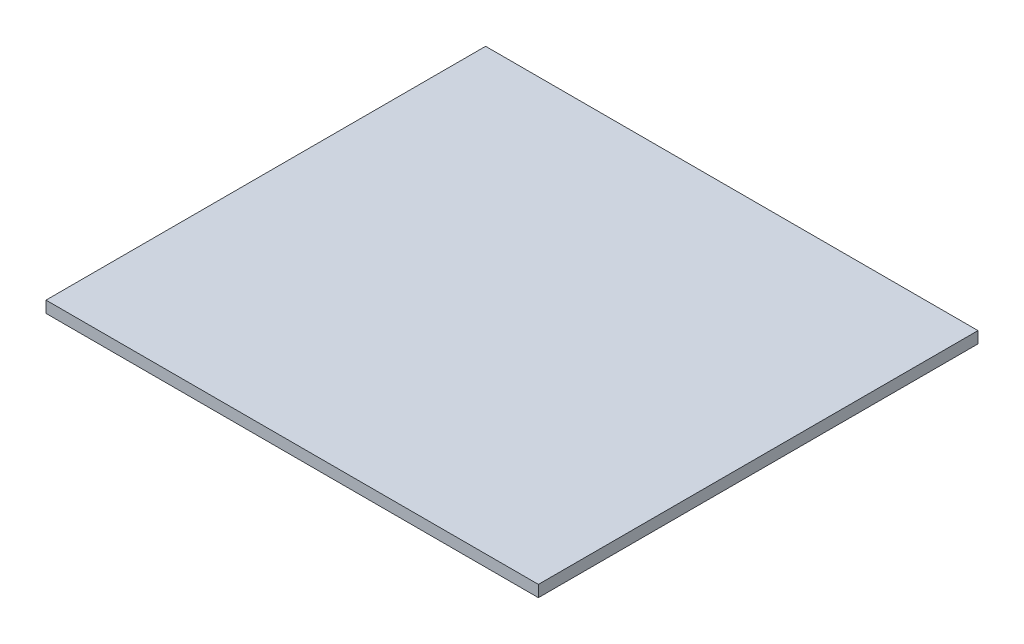
ISO-10303-21;
HEADER;
FILE_DESCRIPTION(('STEP AP214'),'2;1');
FILE_NAME('part.step','',(''),(''),'','','');
FILE_SCHEMA(('AUTOMOTIVE_DESIGN { 1 0 10303 214 1 1 1 1 }'));
ENDSEC;
DATA;
#1=APPLICATION_CONTEXT('core data for automotive mechanical design processes');
#2=APPLICATION_PROTOCOL_DEFINITION('international standard','automotive_design',2000,#1);
#3=PRODUCT_CONTEXT('',#1,'mechanical');
#4=PRODUCT('Part','Part','',(#3));
#5=PRODUCT_RELATED_PRODUCT_CATEGORY('part','',(#4));
#6=PRODUCT_DEFINITION_FORMATION('','',#4);
#7=PRODUCT_DEFINITION_CONTEXT('part definition',#1,'design');
#8=PRODUCT_DEFINITION('design','',#6,#7);
#9=PRODUCT_DEFINITION_SHAPE('','',#8);
#10=(LENGTH_UNIT() NAMED_UNIT(*) SI_UNIT(.MILLI.,.METRE.));
#11=(NAMED_UNIT(*) PLANE_ANGLE_UNIT() SI_UNIT($,.RADIAN.));
#12=(NAMED_UNIT(*) SI_UNIT($,.STERADIAN.) SOLID_ANGLE_UNIT());
#13=UNCERTAINTY_MEASURE_WITH_UNIT(LENGTH_MEASURE(1.E-05),#10,'distance_accuracy_value','');
#14=(GEOMETRIC_REPRESENTATION_CONTEXT(3) GLOBAL_UNCERTAINTY_ASSIGNED_CONTEXT((#13)) GLOBAL_UNIT_ASSIGNED_CONTEXT((#10,
#11,#12)) REPRESENTATION_CONTEXT('',''));
#15=CARTESIAN_POINT('',(0.,0.,0.));
#16=DIRECTION('',(0.,0.,1.));
#17=DIRECTION('',(1.,0.,0.));
#18=AXIS2_PLACEMENT_3D('',#15,#16,#17);
#19=CARTESIAN_POINT('',(29.85,1.4,-26.65));
#20=DIRECTION('',(-1.,0.,0.));
#21=DIRECTION('',(0.,0.,1.));
#22=AXIS2_PLACEMENT_3D('',#19,#20,#21);
#23=PLANE('',#22);
#24=DIRECTION('',(0.,0.,-1.));
#25=VECTOR('',#24,1.);
#26=CARTESIAN_POINT('',(29.85,0.,-26.65));
#27=LINE('',#26,#25);
#28=CARTESIAN_POINT('',(29.85,0.,26.65));
#29=VERTEX_POINT('',#28);
#30=CARTESIAN_POINT('',(29.85,0.,-26.65));
#31=VERTEX_POINT('',#30);
#32=EDGE_CURVE('E94',#29,#31,#27,.T.);
#33=ORIENTED_EDGE('',*,*,#32,.T.);
#34=DIRECTION('',(0.,-1.,0.));
#35=VECTOR('',#34,1.);
#36=CARTESIAN_POINT('',(29.85,1.4,-26.65));
#37=LINE('',#36,#35);
#38=CARTESIAN_POINT('',(29.85,1.4,-26.65));
#39=VERTEX_POINT('',#38);
#40=EDGE_CURVE('E11',#39,#31,#37,.T.);
#41=ORIENTED_EDGE('',*,*,#40,.F.);
#42=DIRECTION('',(0.,0.,-1.));
#43=VECTOR('',#42,1.);
#44=CARTESIAN_POINT('',(29.85,1.4,-26.65));
#45=LINE('',#44,#43);
#46=CARTESIAN_POINT('',(29.85,1.4,26.65));
#47=VERTEX_POINT('',#46);
#48=EDGE_CURVE('E82',#47,#39,#45,.T.);
#49=ORIENTED_EDGE('',*,*,#48,.F.);
#50=DIRECTION('',(0.,-1.,0.));
#51=VECTOR('',#50,1.);
#52=CARTESIAN_POINT('',(29.85,1.4,26.65));
#53=LINE('',#52,#51);
#54=EDGE_CURVE('E90',#47,#29,#53,.T.);
#55=ORIENTED_EDGE('',*,*,#54,.T.);
#56=EDGE_LOOP('',(#33,#41,#49,#55));
#57=FACE_BOUND('',#56,.T.);
#58=ADVANCED_FACE('F31',(#57),#23,.F.);
#59=CARTESIAN_POINT('',(-29.85,1.4,-26.65));
#60=DIRECTION('',(0.,0.,1.));
#61=DIRECTION('',(1.,0.,0.));
#62=AXIS2_PLACEMENT_3D('',#59,#60,#61);
#63=PLANE('',#62);
#64=DIRECTION('',(-1.,0.,0.));
#65=VECTOR('',#64,1.);
#66=CARTESIAN_POINT('',(-29.85,0.,-26.65));
#67=LINE('',#66,#65);
#68=CARTESIAN_POINT('',(-29.85,0.,-26.65));
#69=VERTEX_POINT('',#68);
#70=EDGE_CURVE('E86',#31,#69,#67,.T.);
#71=ORIENTED_EDGE('',*,*,#70,.T.);
#72=DIRECTION('',(0.,-1.,0.));
#73=VECTOR('',#72,1.);
#74=CARTESIAN_POINT('',(-29.85,1.4,-26.65));
#75=LINE('',#74,#73);
#76=CARTESIAN_POINT('',(-29.85,1.4,-26.65));
#77=VERTEX_POINT('',#76);
#78=EDGE_CURVE('E39',#77,#69,#75,.T.);
#79=ORIENTED_EDGE('',*,*,#78,.F.);
#80=DIRECTION('',(-1.,0.,0.));
#81=VECTOR('',#80,1.);
#82=CARTESIAN_POINT('',(-29.85,1.4,-26.65));
#83=LINE('',#82,#81);
#84=EDGE_CURVE('E77',#39,#77,#83,.T.);
#85=ORIENTED_EDGE('',*,*,#84,.F.);
#86=ORIENTED_EDGE('',*,*,#40,.T.);
#87=EDGE_LOOP('',(#71,#79,#85,#86));
#88=FACE_BOUND('',#87,.T.);
#89=ADVANCED_FACE('F85',(#88),#63,.F.);
#90=CARTESIAN_POINT('',(-29.85,1.4,-26.65));
#91=DIRECTION('',(1.,0.,0.));
#92=DIRECTION('',(0.,0.,-1.));
#93=AXIS2_PLACEMENT_3D('',#90,#91,#92);
#94=PLANE('',#93);
#95=DIRECTION('',(0.,0.,1.));
#96=VECTOR('',#95,1.);
#97=CARTESIAN_POINT('',(-29.85,0.,-26.65));
#98=LINE('',#97,#96);
#99=CARTESIAN_POINT('',(-29.85,0.,26.65));
#100=VERTEX_POINT('',#99);
#101=EDGE_CURVE('E64',#69,#100,#98,.T.);
#102=ORIENTED_EDGE('',*,*,#101,.T.);
#103=DIRECTION('',(0.,-1.,0.));
#104=VECTOR('',#103,1.);
#105=CARTESIAN_POINT('',(-29.85,1.4,26.65));
#106=LINE('',#105,#104);
#107=CARTESIAN_POINT('',(-29.85,1.4,26.65));
#108=VERTEX_POINT('',#107);
#109=EDGE_CURVE('E87',#108,#100,#106,.T.);
#110=ORIENTED_EDGE('',*,*,#109,.F.);
#111=DIRECTION('',(0.,0.,1.));
#112=VECTOR('',#111,1.);
#113=CARTESIAN_POINT('',(-29.85,1.4,-26.65));
#114=LINE('',#113,#112);
#115=EDGE_CURVE('E80',#77,#108,#114,.T.);
#116=ORIENTED_EDGE('',*,*,#115,.F.);
#117=ORIENTED_EDGE('',*,*,#78,.T.);
#118=EDGE_LOOP('',(#102,#110,#116,#117));
#119=FACE_BOUND('',#118,.T.);
#120=ADVANCED_FACE('F88',(#119),#94,.F.);
#121=CARTESIAN_POINT('',(-29.85,1.4,26.65));
#122=DIRECTION('',(0.,0.,-1.));
#123=DIRECTION('',(-1.,0.,0.));
#124=AXIS2_PLACEMENT_3D('',#121,#122,#123);
#125=PLANE('',#124);
#126=DIRECTION('',(1.,0.,0.));
#127=VECTOR('',#126,1.);
#128=CARTESIAN_POINT('',(-29.85,0.,26.65));
#129=LINE('',#128,#127);
#130=EDGE_CURVE('E70',#100,#29,#129,.T.);
#131=ORIENTED_EDGE('',*,*,#130,.T.);
#132=ORIENTED_EDGE('',*,*,#54,.F.);
#133=DIRECTION('',(1.,0.,0.));
#134=VECTOR('',#133,1.);
#135=CARTESIAN_POINT('',(-29.85,1.4,26.65));
#136=LINE('',#135,#134);
#137=EDGE_CURVE('E47',#108,#47,#136,.T.);
#138=ORIENTED_EDGE('',*,*,#137,.F.);
#139=ORIENTED_EDGE('',*,*,#109,.T.);
#140=EDGE_LOOP('',(#131,#132,#138,#139));
#141=FACE_BOUND('',#140,.T.);
#142=ADVANCED_FACE('F101',(#141),#125,.F.);
#143=CARTESIAN_POINT('',(29.85,1.4,26.65));
#144=DIRECTION('',(0.,1.,0.));
#145=DIRECTION('',(0.,0.,1.));
#146=AXIS2_PLACEMENT_3D('',#143,#144,#145);
#147=PLANE('',#146);
#148=ORIENTED_EDGE('',*,*,#48,.T.);
#149=ORIENTED_EDGE('',*,*,#84,.T.);
#150=ORIENTED_EDGE('',*,*,#115,.T.);
#151=ORIENTED_EDGE('',*,*,#137,.T.);
#152=EDGE_LOOP('',(#148,#149,#150,#151));
#153=FACE_BOUND('',#152,.T.);
#154=ADVANCED_FACE('F78',(#153),#147,.T.);
#155=CARTESIAN_POINT('',(29.85,0.,26.65));
#156=DIRECTION('',(0.,1.,0.));
#157=DIRECTION('',(0.,0.,1.));
#158=AXIS2_PLACEMENT_3D('',#155,#156,#157);
#159=PLANE('',#158);
#160=ORIENTED_EDGE('',*,*,#32,.F.);
#161=ORIENTED_EDGE('',*,*,#130,.F.);
#162=ORIENTED_EDGE('',*,*,#101,.F.);
#163=ORIENTED_EDGE('',*,*,#70,.F.);
#164=EDGE_LOOP('',(#160,#161,#162,#163));
#165=FACE_BOUND('',#164,.T.);
#166=ADVANCED_FACE('F104',(#165),#159,.F.);
#167=CLOSED_SHELL('',(#58,#89,#120,#142,#154,#166));
#168=MANIFOLD_SOLID_BREP('B2',#167);
#169=ADVANCED_BREP_SHAPE_REPRESENTATION('',(#18,#168),#14);
#170=SHAPE_DEFINITION_REPRESENTATION(#9,#169);
ENDSEC;
END-ISO-10303-21;
